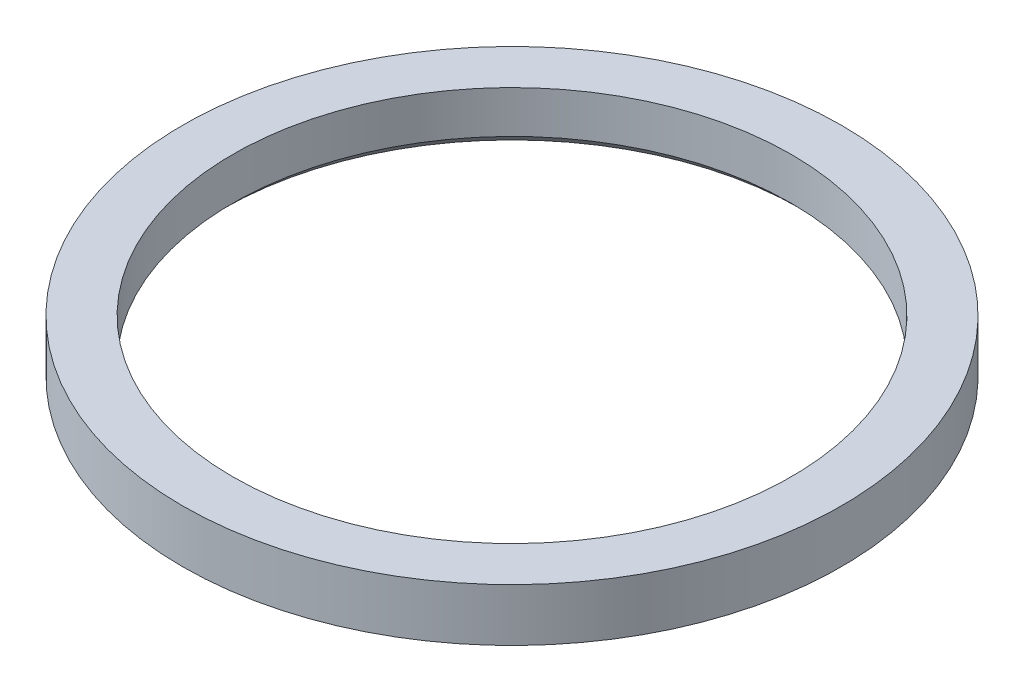
ISO-10303-21;
HEADER;
FILE_DESCRIPTION(('STEP AP214'),'2;1');
FILE_NAME('part.step','',(''),(''),'','','');
FILE_SCHEMA(('AUTOMOTIVE_DESIGN { 1 0 10303 214 1 1 1 1 }'));
ENDSEC;
DATA;
#1=APPLICATION_CONTEXT('core data for automotive mechanical design processes');
#2=APPLICATION_PROTOCOL_DEFINITION('international standard','automotive_design',2000,#1);
#3=PRODUCT_CONTEXT('',#1,'mechanical');
#4=PRODUCT('Part','Part','',(#3));
#5=PRODUCT_RELATED_PRODUCT_CATEGORY('part','',(#4));
#6=PRODUCT_DEFINITION_FORMATION('','',#4);
#7=PRODUCT_DEFINITION_CONTEXT('part definition',#1,'design');
#8=PRODUCT_DEFINITION('design','',#6,#7);
#9=PRODUCT_DEFINITION_SHAPE('','',#8);
#10=(LENGTH_UNIT() NAMED_UNIT(*) SI_UNIT(.MILLI.,.METRE.));
#11=(NAMED_UNIT(*) PLANE_ANGLE_UNIT() SI_UNIT($,.RADIAN.));
#12=(NAMED_UNIT(*) SI_UNIT($,.STERADIAN.) SOLID_ANGLE_UNIT());
#13=UNCERTAINTY_MEASURE_WITH_UNIT(LENGTH_MEASURE(1.E-05),#10,'distance_accuracy_value','');
#14=(GEOMETRIC_REPRESENTATION_CONTEXT(3) GLOBAL_UNCERTAINTY_ASSIGNED_CONTEXT((#13)) GLOBAL_UNIT_ASSIGNED_CONTEXT((#10,
#11,#12)) REPRESENTATION_CONTEXT('',''));
#15=CARTESIAN_POINT('',(0.,0.,0.));
#16=DIRECTION('',(0.,0.,1.));
#17=DIRECTION('',(1.,0.,0.));
#18=AXIS2_PLACEMENT_3D('',#15,#16,#17);
#19=CARTESIAN_POINT('',(0.,1.52,0.));
#20=DIRECTION('',(0.,-1.,0.));
#21=DIRECTION('',(0.,0.,-1.));
#22=AXIS2_PLACEMENT_3D('',#19,#20,#21);
#23=CYLINDRICAL_SURFACE('',#22,9.5);
#24=CARTESIAN_POINT('',(0.,1.52,0.));
#25=DIRECTION('',(0.,1.,0.));
#26=DIRECTION('',(0.,0.,1.));
#27=AXIS2_PLACEMENT_3D('',#24,#25,#26);
#28=CIRCLE('',#27,9.5);
#29=CARTESIAN_POINT('',(0.,1.52,9.5));
#30=VERTEX_POINT('',#29);
#31=EDGE_CURVE('E58',#30,#30,#28,.T.);
#32=ORIENTED_EDGE('',*,*,#31,.F.);
#33=EDGE_LOOP('',(#32));
#34=FACE_BOUND('',#33,.T.);
#35=CARTESIAN_POINT('',(0.,0.,0.));
#36=DIRECTION('',(0.,1.,0.));
#37=DIRECTION('',(0.,0.,1.));
#38=AXIS2_PLACEMENT_3D('',#35,#36,#37);
#39=CIRCLE('',#38,9.5);
#40=CARTESIAN_POINT('',(0.,0.,9.5));
#41=VERTEX_POINT('',#40);
#42=EDGE_CURVE('E62',#41,#41,#39,.T.);
#43=ORIENTED_EDGE('',*,*,#42,.T.);
#44=EDGE_LOOP('',(#43));
#45=FACE_BOUND('',#44,.T.);
#46=ADVANCED_FACE('F47',(#34,#45),#23,.T.);
#47=CARTESIAN_POINT('',(0.,1.52,0.));
#48=DIRECTION('',(0.,1.,0.));
#49=DIRECTION('',(0.,0.,1.));
#50=AXIS2_PLACEMENT_3D('',#47,#48,#49);
#51=PLANE('',#50);
#52=CARTESIAN_POINT('',(0.,1.52,0.));
#53=DIRECTION('',(0.,1.,0.));
#54=DIRECTION('',(0.,0.,1.));
#55=AXIS2_PLACEMENT_3D('',#52,#53,#54);
#56=CIRCLE('',#55,8.05);
#57=CARTESIAN_POINT('',(0.,1.52,8.05));
#58=VERTEX_POINT('',#57);
#59=EDGE_CURVE('E66',#58,#58,#56,.T.);
#60=ORIENTED_EDGE('',*,*,#59,.F.);
#61=EDGE_LOOP('',(#60));
#62=FACE_BOUND('',#61,.T.);
#63=ORIENTED_EDGE('',*,*,#31,.T.);
#64=EDGE_LOOP('',(#63));
#65=FACE_BOUND('',#64,.T.);
#66=ADVANCED_FACE('F73',(#62,#65),#51,.T.);
#67=CARTESIAN_POINT('',(0.,0.,0.));
#68=DIRECTION('',(0.,1.,0.));
#69=DIRECTION('',(0.,0.,1.));
#70=AXIS2_PLACEMENT_3D('',#67,#68,#69);
#71=PLANE('',#70);
#72=CARTESIAN_POINT('',(0.,0.,0.));
#73=DIRECTION('',(0.,1.,0.));
#74=DIRECTION('',(0.,0.,1.));
#75=AXIS2_PLACEMENT_3D('',#72,#73,#74);
#76=CIRCLE('',#75,8.35);
#77=CARTESIAN_POINT('',(0.,0.,8.35));
#78=VERTEX_POINT('',#77);
#79=EDGE_CURVE('E54',#78,#78,#76,.T.);
#80=ORIENTED_EDGE('',*,*,#79,.T.);
#81=EDGE_LOOP('',(#80));
#82=FACE_BOUND('',#81,.T.);
#83=ORIENTED_EDGE('',*,*,#42,.F.);
#84=EDGE_LOOP('',(#83));
#85=FACE_BOUND('',#84,.T.);
#86=ADVANCED_FACE('F76',(#82,#85),#71,.F.);
#87=CARTESIAN_POINT('',(0.,0.,0.));
#88=DIRECTION('',(0.,1.,0.));
#89=DIRECTION('',(0.,0.,1.));
#90=AXIS2_PLACEMENT_3D('',#87,#88,#89);
#91=CYLINDRICAL_SURFACE('',#90,8.05);
#92=CARTESIAN_POINT('',(0.,0.300000000000002,0.));
#93=DIRECTION('',(0.,1.,0.));
#94=DIRECTION('',(0.,0.,1.));
#95=AXIS2_PLACEMENT_3D('',#92,#93,#94);
#96=CIRCLE('',#95,8.05);
#97=CARTESIAN_POINT('',(0.,0.300000000000002,8.05));
#98=VERTEX_POINT('',#97);
#99=EDGE_CURVE('E12',#98,#98,#96,.F.);
#100=ORIENTED_EDGE('',*,*,#99,.T.);
#101=EDGE_LOOP('',(#100));
#102=FACE_BOUND('',#101,.T.);
#103=ORIENTED_EDGE('',*,*,#59,.T.);
#104=EDGE_LOOP('',(#103));
#105=FACE_BOUND('',#104,.T.);
#106=ADVANCED_FACE('F71',(#102,#105),#91,.F.);
#107=CARTESIAN_POINT('',(0.,0.,0.));
#108=DIRECTION('',(0.,-1.,0.));
#109=DIRECTION('',(0.,0.,-1.));
#110=AXIS2_PLACEMENT_3D('',#107,#108,#109);
#111=CONICAL_SURFACE('',#110,8.35,0.785398163397443);
#112=ORIENTED_EDGE('',*,*,#99,.F.);
#113=EDGE_LOOP('',(#112));
#114=FACE_BOUND('',#113,.T.);
#115=ORIENTED_EDGE('',*,*,#79,.F.);
#116=EDGE_LOOP('',(#115));
#117=FACE_BOUND('',#116,.T.);
#118=ADVANCED_FACE('F49',(#114,#117),#111,.F.);
#119=CLOSED_SHELL('',(#46,#66,#86,#106,#118));
#120=MANIFOLD_SOLID_BREP('B2',#119);
#121=ADVANCED_BREP_SHAPE_REPRESENTATION('',(#18,#120),#14);
#122=SHAPE_DEFINITION_REPRESENTATION(#9,#121);
ENDSEC;
END-ISO-10303-21;
